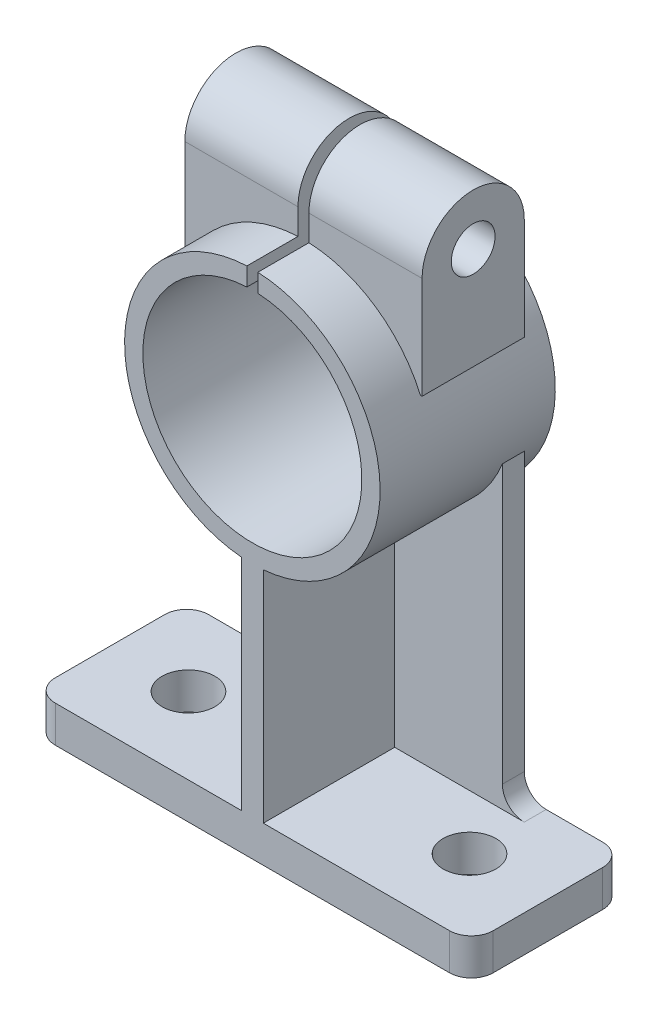
ISO-10303-21;
HEADER;
FILE_DESCRIPTION(('STEP AP214'),'2;1');
FILE_NAME('part.step','',(''),(''),'','','');
FILE_SCHEMA(('AUTOMOTIVE_DESIGN { 1 0 10303 214 1 1 1 1 }'));
ENDSEC;
DATA;
#1=APPLICATION_CONTEXT('core data for automotive mechanical design processes');
#2=APPLICATION_PROTOCOL_DEFINITION('international standard','automotive_design',2000,#1);
#3=PRODUCT_CONTEXT('',#1,'mechanical');
#4=PRODUCT('Part','Part','',(#3));
#5=PRODUCT_RELATED_PRODUCT_CATEGORY('part','',(#4));
#6=PRODUCT_DEFINITION_FORMATION('','',#4);
#7=PRODUCT_DEFINITION_CONTEXT('part definition',#1,'design');
#8=PRODUCT_DEFINITION('design','',#6,#7);
#9=PRODUCT_DEFINITION_SHAPE('','',#8);
#10=(LENGTH_UNIT() NAMED_UNIT(*) SI_UNIT(.MILLI.,.METRE.));
#11=(NAMED_UNIT(*) PLANE_ANGLE_UNIT() SI_UNIT($,.RADIAN.));
#12=(NAMED_UNIT(*) SI_UNIT($,.STERADIAN.) SOLID_ANGLE_UNIT());
#13=UNCERTAINTY_MEASURE_WITH_UNIT(LENGTH_MEASURE(1.E-05),#10,'distance_accuracy_value','');
#14=(GEOMETRIC_REPRESENTATION_CONTEXT(3) GLOBAL_UNCERTAINTY_ASSIGNED_CONTEXT((#13)) GLOBAL_UNIT_ASSIGNED_CONTEXT((#10,
#11,#12)) REPRESENTATION_CONTEXT('',''));
#15=CARTESIAN_POINT('',(0.,0.,0.));
#16=DIRECTION('',(0.,0.,1.));
#17=DIRECTION('',(1.,0.,0.));
#18=AXIS2_PLACEMENT_3D('',#15,#16,#17);
#19=CARTESIAN_POINT('',(0.,105.,42.));
#20=DIRECTION('',(0.,0.,-1.));
#21=DIRECTION('',(-1.,0.,0.));
#22=AXIS2_PLACEMENT_3D('',#19,#20,#21);
#23=CYLINDRICAL_SURFACE('',#22,35.);
#24=DIRECTION('',(0.,0.,-1.));
#25=VECTOR('',#24,1.);
#26=CARTESIAN_POINT('',(1.5,139.967842369812,42.));
#27=LINE('',#26,#25);
#28=CARTESIAN_POINT('',(1.5,139.967842369812,42.));
#29=VERTEX_POINT('',#28);
#30=CARTESIAN_POINT('',(1.5,139.967842369812,28.));
#31=VERTEX_POINT('',#30);
#32=EDGE_CURVE('E77',#29,#31,#27,.T.);
#33=ORIENTED_EDGE('',*,*,#32,.F.);
#34=CARTESIAN_POINT('',(0.,105.,42.));
#35=DIRECTION('',(0.,0.,1.));
#36=DIRECTION('',(1.,0.,0.));
#37=AXIS2_PLACEMENT_3D('',#34,#35,#36);
#38=CIRCLE('',#37,35.);
#39=CARTESIAN_POINT('',(3.0000000000002,70.1288084516746,42.));
#40=VERTEX_POINT('',#39);
#41=EDGE_CURVE('E294',#40,#29,#38,.T.);
#42=ORIENTED_EDGE('',*,*,#41,.F.);
#43=DIRECTION('',(0.,0.,-1.));
#44=VECTOR('',#43,1.);
#45=CARTESIAN_POINT('',(3.,70.1288084516746,42.));
#46=LINE('',#45,#44);
#47=CARTESIAN_POINT('',(3.,70.1288084516746,6.));
#48=VERTEX_POINT('',#47);
#49=EDGE_CURVE('E597',#40,#48,#46,.T.);
#50=ORIENTED_EDGE('',*,*,#49,.T.);
#51=CARTESIAN_POINT('',(0.,105.,6.));
#52=DIRECTION('',(0.,0.,1.));
#53=DIRECTION('',(1.,0.,0.));
#54=AXIS2_PLACEMENT_3D('',#51,#52,#53);
#55=CIRCLE('',#54,35.);
#56=CARTESIAN_POINT('',(32.5,92.0096189432335,6.));
#57=VERTEX_POINT('',#56);
#58=EDGE_CURVE('E12',#57,#48,#55,.F.);
#59=ORIENTED_EDGE('',*,*,#58,.F.);
#60=DIRECTION('',(0.,0.,-1.));
#61=VECTOR('',#60,1.);
#62=CARTESIAN_POINT('',(32.5,92.0096189432335,42.));
#63=LINE('',#62,#61);
#64=CARTESIAN_POINT('',(32.5,92.0096189432335,0.));
#65=VERTEX_POINT('',#64);
#66=EDGE_CURVE('E305',#57,#65,#63,.T.);
#67=ORIENTED_EDGE('',*,*,#66,.T.);
#68=CARTESIAN_POINT('',(0.,105.,0.));
#69=DIRECTION('',(0.,0.,1.));
#70=DIRECTION('',(1.,0.,0.));
#71=AXIS2_PLACEMENT_3D('',#68,#69,#70);
#72=CIRCLE('',#71,35.);
#73=CARTESIAN_POINT('',(-32.5,92.0096189432334,0.));
#74=VERTEX_POINT('',#73);
#75=EDGE_CURVE('E308',#65,#74,#72,.F.);
#76=ORIENTED_EDGE('',*,*,#75,.T.);
#77=DIRECTION('',(0.,0.,-1.));
#78=VECTOR('',#77,1.);
#79=CARTESIAN_POINT('',(-32.5,92.0096189432334,42.));
#80=LINE('',#79,#78);
#81=CARTESIAN_POINT('',(-32.5,92.0096189432334,6.));
#82=VERTEX_POINT('',#81);
#83=EDGE_CURVE('E301',#74,#82,#80,.F.);
#84=ORIENTED_EDGE('',*,*,#83,.T.);
#85=CARTESIAN_POINT('',(-3.,70.1288084516746,6.));
#86=VERTEX_POINT('',#85);
#87=EDGE_CURVE('E61',#86,#82,#55,.F.);
#88=ORIENTED_EDGE('',*,*,#87,.F.);
#89=DIRECTION('',(0.,0.,-1.));
#90=VECTOR('',#89,1.);
#91=CARTESIAN_POINT('',(-3.,70.1288084516746,42.));
#92=LINE('',#91,#90);
#93=CARTESIAN_POINT('',(-3.,70.1288084516746,42.));
#94=VERTEX_POINT('',#93);
#95=EDGE_CURVE('E594',#94,#86,#92,.T.);
#96=ORIENTED_EDGE('',*,*,#95,.F.);
#97=CARTESIAN_POINT('',(-1.5,139.967842369812,42.));
#98=VERTEX_POINT('',#97);
#99=EDGE_CURVE('E289',#98,#94,#38,.T.);
#100=ORIENTED_EDGE('',*,*,#99,.F.);
#101=DIRECTION('',(0.,0.,-1.));
#102=VECTOR('',#101,1.);
#103=CARTESIAN_POINT('',(-1.5,139.967842369812,42.));
#104=LINE('',#103,#102);
#105=CARTESIAN_POINT('',(-1.5,139.967842369812,28.));
#106=VERTEX_POINT('',#105);
#107=EDGE_CURVE('E284',#106,#98,#104,.F.);
#108=ORIENTED_EDGE('',*,*,#107,.F.);
#109=CARTESIAN_POINT('',(0.,105.,28.));
#110=DIRECTION('',(0.,0.,-1.));
#111=DIRECTION('',(-1.,0.,0.));
#112=AXIS2_PLACEMENT_3D('',#109,#110,#111);
#113=CIRCLE('',#112,35.);
#114=CARTESIAN_POINT('',(-32.0631442274312,119.034057939561,28.));
#115=VERTEX_POINT('',#114);
#116=EDGE_CURVE('E569',#115,#106,#113,.T.);
#117=ORIENTED_EDGE('',*,*,#116,.F.);
#118=DIRECTION('',(0.,0.,-1.));
#119=VECTOR('',#118,1.);
#120=CARTESIAN_POINT('',(-32.0631442274312,119.034057939561,42.));
#121=LINE('',#120,#119);
#122=CARTESIAN_POINT('',(-32.0631442274312,119.034057939561,0.));
#123=VERTEX_POINT('',#122);
#124=EDGE_CURVE('E560',#123,#115,#121,.F.);
#125=ORIENTED_EDGE('',*,*,#124,.F.);
#126=CARTESIAN_POINT('',(0.,105.,0.));
#127=DIRECTION('',(0.,0.,1.));
#128=DIRECTION('',(1.,0.,0.));
#129=AXIS2_PLACEMENT_3D('',#126,#127,#128);
#130=CIRCLE('',#129,35.);
#131=CARTESIAN_POINT('',(-1.5,139.967842369812,0.));
#132=VERTEX_POINT('',#131);
#133=EDGE_CURVE('E282',#132,#123,#130,.T.);
#134=ORIENTED_EDGE('',*,*,#133,.F.);
#135=CARTESIAN_POINT('',(-1.5,139.967842369812,-6.));
#136=VERTEX_POINT('',#135);
#137=EDGE_CURVE('E264',#136,#132,#104,.F.);
#138=ORIENTED_EDGE('',*,*,#137,.F.);
#139=CARTESIAN_POINT('',(0.,105.,-6.));
#140=DIRECTION('',(0.,0.,1.));
#141=DIRECTION('',(1.,0.,0.));
#142=AXIS2_PLACEMENT_3D('',#139,#140,#141);
#143=CIRCLE('',#142,35.);
#144=CARTESIAN_POINT('',(1.5,139.967842369812,-6.));
#145=VERTEX_POINT('',#144);
#146=EDGE_CURVE('E280',#136,#145,#143,.T.);
#147=ORIENTED_EDGE('',*,*,#146,.T.);
#148=CARTESIAN_POINT('',(1.5,139.967842369812,0.));
#149=VERTEX_POINT('',#148);
#150=EDGE_CURVE('E497',#149,#145,#27,.T.);
#151=ORIENTED_EDGE('',*,*,#150,.F.);
#152=CARTESIAN_POINT('',(32.0631442274312,119.034057939561,0.));
#153=VERTEX_POINT('',#152);
#154=EDGE_CURVE('E573',#153,#149,#130,.T.);
#155=ORIENTED_EDGE('',*,*,#154,.F.);
#156=DIRECTION('',(0.,0.,-1.));
#157=VECTOR('',#156,1.);
#158=CARTESIAN_POINT('',(32.0631442274312,119.034057939561,42.));
#159=LINE('',#158,#157);
#160=CARTESIAN_POINT('',(32.0631442274312,119.034057939561,28.));
#161=VERTEX_POINT('',#160);
#162=EDGE_CURVE('E564',#161,#153,#159,.T.);
#163=ORIENTED_EDGE('',*,*,#162,.F.);
#164=EDGE_CURVE('E568',#31,#161,#113,.T.);
#165=ORIENTED_EDGE('',*,*,#164,.F.);
#166=EDGE_LOOP('',(#33,#42,#50,#59,#67,#76,#84,#88,#96,#100,#108,#117,#125,#134,#138,#147,#151,
#155,#163,#165));
#167=FACE_BOUND('',#166,.T.);
#168=ADVANCED_FACE('F51',(#167),#23,.T.);
#169=CARTESIAN_POINT('',(0.,105.,42.));
#170=DIRECTION('',(0.,0.,-1.));
#171=DIRECTION('',(-1.,0.,0.));
#172=AXIS2_PLACEMENT_3D('',#169,#170,#171);
#173=CYLINDRICAL_SURFACE('',#172,30.);
#174=CARTESIAN_POINT('',(0.,105.,42.));
#175=DIRECTION('',(0.,0.,1.));
#176=DIRECTION('',(1.,0.,0.));
#177=AXIS2_PLACEMENT_3D('',#174,#175,#176);
#178=CIRCLE('',#177,30.);
#179=CARTESIAN_POINT('',(-1.5,134.962476533157,42.));
#180=VERTEX_POINT('',#179);
#181=CARTESIAN_POINT('',(1.5,134.962476533157,42.));
#182=VERTEX_POINT('',#181);
#183=EDGE_CURVE('E290',#180,#182,#178,.T.);
#184=ORIENTED_EDGE('',*,*,#183,.T.);
#185=DIRECTION('',(0.,0.,-1.));
#186=VECTOR('',#185,1.);
#187=CARTESIAN_POINT('',(1.5,134.962476533157,42.));
#188=LINE('',#187,#186);
#189=CARTESIAN_POINT('',(1.5,134.962476533157,-6.));
#190=VERTEX_POINT('',#189);
#191=EDGE_CURVE('E500',#182,#190,#188,.T.);
#192=ORIENTED_EDGE('',*,*,#191,.T.);
#193=CARTESIAN_POINT('',(0.,105.,-6.));
#194=DIRECTION('',(0.,0.,1.));
#195=DIRECTION('',(1.,0.,0.));
#196=AXIS2_PLACEMENT_3D('',#193,#194,#195);
#197=CIRCLE('',#196,30.);
#198=CARTESIAN_POINT('',(-1.5,134.962476533157,-6.));
#199=VERTEX_POINT('',#198);
#200=EDGE_CURVE('E297',#199,#190,#197,.T.);
#201=ORIENTED_EDGE('',*,*,#200,.F.);
#202=DIRECTION('',(0.,0.,-1.));
#203=VECTOR('',#202,1.);
#204=CARTESIAN_POINT('',(-1.5,134.962476533157,42.));
#205=LINE('',#204,#203);
#206=EDGE_CURVE('E267',#199,#180,#205,.F.);
#207=ORIENTED_EDGE('',*,*,#206,.T.);
#208=EDGE_LOOP('',(#184,#192,#201,#207));
#209=FACE_BOUND('',#208,.T.);
#210=ADVANCED_FACE('F605',(#209),#173,.F.);
#211=CARTESIAN_POINT('',(-60.,10.,42.));
#212=DIRECTION('',(0.,0.,-1.));
#213=DIRECTION('',(-1.,0.,0.));
#214=AXIS2_PLACEMENT_3D('',#211,#212,#213);
#215=PLANE('',#214);
#216=DIRECTION('',(0.,1.,0.));
#217=VECTOR('',#216,1.);
#218=CARTESIAN_POINT('',(1.5,105.,42.));
#219=LINE('',#218,#217);
#220=EDGE_CURVE('E273',#182,#29,#219,.T.);
#221=ORIENTED_EDGE('',*,*,#220,.F.);
#222=ORIENTED_EDGE('',*,*,#183,.F.);
#223=DIRECTION('',(0.,-1.,0.));
#224=VECTOR('',#223,1.);
#225=CARTESIAN_POINT('',(-1.5,105.,42.));
#226=LINE('',#225,#224);
#227=EDGE_CURVE('E467',#98,#180,#226,.T.);
#228=ORIENTED_EDGE('',*,*,#227,.F.);
#229=ORIENTED_EDGE('',*,*,#99,.T.);
#230=DIRECTION('',(0.,-1.,0.));
#231=VECTOR('',#230,1.);
#232=CARTESIAN_POINT('',(-3.,10.,42.));
#233=LINE('',#232,#231);
#234=CARTESIAN_POINT('',(-3.,10.,42.));
#235=VERTEX_POINT('',#234);
#236=EDGE_CURVE('E582',#94,#235,#233,.T.);
#237=ORIENTED_EDGE('',*,*,#236,.T.);
#238=DIRECTION('',(1.,0.,0.));
#239=VECTOR('',#238,1.);
#240=CARTESIAN_POINT('',(-60.,10.,42.));
#241=LINE('',#240,#239);
#242=CARTESIAN_POINT('',(-54.,10.,42.));
#243=VERTEX_POINT('',#242);
#244=EDGE_CURVE('E362',#243,#235,#241,.T.);
#245=ORIENTED_EDGE('',*,*,#244,.F.);
#246=DIRECTION('',(0.,-1.,0.));
#247=VECTOR('',#246,1.);
#248=CARTESIAN_POINT('',(-54.,10.,42.));
#249=LINE('',#248,#247);
#250=CARTESIAN_POINT('',(-54.,0.,42.));
#251=VERTEX_POINT('',#250);
#252=EDGE_CURVE('E399',#243,#251,#249,.T.);
#253=ORIENTED_EDGE('',*,*,#252,.T.);
#254=DIRECTION('',(1.,0.,0.));
#255=VECTOR('',#254,1.);
#256=CARTESIAN_POINT('',(-60.,0.,42.));
#257=LINE('',#256,#255);
#258=CARTESIAN_POINT('',(54.,0.,42.));
#259=VERTEX_POINT('',#258);
#260=EDGE_CURVE('E352',#251,#259,#257,.T.);
#261=ORIENTED_EDGE('',*,*,#260,.T.);
#262=DIRECTION('',(0.,-1.,0.));
#263=VECTOR('',#262,1.);
#264=CARTESIAN_POINT('',(54.,10.,42.));
#265=LINE('',#264,#263);
#266=CARTESIAN_POINT('',(54.,10.,42.));
#267=VERTEX_POINT('',#266);
#268=EDGE_CURVE('E403',#259,#267,#265,.F.);
#269=ORIENTED_EDGE('',*,*,#268,.T.);
#270=CARTESIAN_POINT('',(3.,10.,42.));
#271=VERTEX_POINT('',#270);
#272=EDGE_CURVE('E361',#271,#267,#241,.T.);
#273=ORIENTED_EDGE('',*,*,#272,.F.);
#274=DIRECTION('',(0.,1.,0.));
#275=VECTOR('',#274,1.);
#276=CARTESIAN_POINT('',(3.,10.,42.));
#277=LINE('',#276,#275);
#278=EDGE_CURVE('E578',#271,#40,#277,.T.);
#279=ORIENTED_EDGE('',*,*,#278,.T.);
#280=ORIENTED_EDGE('',*,*,#41,.T.);
#281=EDGE_LOOP('',(#221,#222,#228,#229,#237,#245,#253,#261,#269,#273,#279,#280));
#282=FACE_BOUND('',#281,.T.);
#283=ADVANCED_FACE('F611',(#282),#215,.F.);
#284=CARTESIAN_POINT('',(0.,105.,-6.));
#285=DIRECTION('',(0.,0.,1.));
#286=DIRECTION('',(1.,0.,0.));
#287=AXIS2_PLACEMENT_3D('',#284,#285,#286);
#288=PLANE('',#287);
#289=DIRECTION('',(0.,1.,0.));
#290=VECTOR('',#289,1.);
#291=CARTESIAN_POINT('',(1.5,105.,-6.));
#292=LINE('',#291,#290);
#293=EDGE_CURVE('E274',#190,#145,#292,.T.);
#294=ORIENTED_EDGE('',*,*,#293,.T.);
#295=ORIENTED_EDGE('',*,*,#146,.F.);
#296=DIRECTION('',(0.,-1.,0.));
#297=VECTOR('',#296,1.);
#298=CARTESIAN_POINT('',(-1.5,105.,-6.));
#299=LINE('',#298,#297);
#300=EDGE_CURVE('E261',#136,#199,#299,.T.);
#301=ORIENTED_EDGE('',*,*,#300,.T.);
#302=ORIENTED_EDGE('',*,*,#200,.T.);
#303=EDGE_LOOP('',(#294,#295,#301,#302));
#304=FACE_BOUND('',#303,.T.);
#305=ADVANCED_FACE('F287',(#304),#288,.F.);
#306=CARTESIAN_POINT('',(32.5,126.068220276628,0.));
#307=DIRECTION('',(0.,0.,1.));
#308=DIRECTION('',(1.,0.,0.));
#309=AXIS2_PLACEMENT_3D('',#306,#307,#308);
#310=PLANE('',#309);
#311=DIRECTION('',(0.,-1.,0.));
#312=VECTOR('',#311,1.);
#313=CARTESIAN_POINT('',(1.5,126.068220276628,0.));
#314=LINE('',#313,#312);
#315=CARTESIAN_POINT('',(1.5,147.,0.));
#316=VERTEX_POINT('',#315);
#317=EDGE_CURVE('E494',#316,#149,#314,.T.);
#318=ORIENTED_EDGE('',*,*,#317,.F.);
#319=DIRECTION('',(-1.,0.,0.));
#320=VECTOR('',#319,1.);
#321=CARTESIAN_POINT('',(32.5,147.,0.));
#322=LINE('',#321,#320);
#323=CARTESIAN_POINT('',(32.5,147.,0.));
#324=VERTEX_POINT('',#323);
#325=EDGE_CURVE('E556',#324,#316,#322,.T.);
#326=ORIENTED_EDGE('',*,*,#325,.F.);
#327=DIRECTION('',(0.,1.,0.));
#328=VECTOR('',#327,1.);
#329=CARTESIAN_POINT('',(32.5,119.034057939561,0.));
#330=LINE('',#329,#328);
#331=CARTESIAN_POINT('',(32.5,119.034057939561,0.));
#332=VERTEX_POINT('',#331);
#333=EDGE_CURVE('E513',#332,#324,#330,.T.);
#334=ORIENTED_EDGE('',*,*,#333,.F.);
#335=DIRECTION('',(-1.,0.,0.));
#336=VECTOR('',#335,1.);
#337=CARTESIAN_POINT('',(32.5,119.034057939561,0.));
#338=LINE('',#337,#336);
#339=EDGE_CURVE('E541',#332,#153,#338,.T.);
#340=ORIENTED_EDGE('',*,*,#339,.T.);
#341=ORIENTED_EDGE('',*,*,#154,.T.);
#342=EDGE_LOOP('',(#318,#326,#334,#340,#341));
#343=FACE_BOUND('',#342,.T.);
#344=ADVANCED_FACE('F926',(#343),#310,.F.);
#345=DIRECTION('',(0.,1.,0.));
#346=VECTOR('',#345,1.);
#347=CARTESIAN_POINT('',(-1.5,126.068220276628,0.));
#348=LINE('',#347,#346);
#349=CARTESIAN_POINT('',(-1.5,147.,0.));
#350=VERTEX_POINT('',#349);
#351=EDGE_CURVE('E482',#132,#350,#348,.T.);
#352=ORIENTED_EDGE('',*,*,#351,.F.);
#353=ORIENTED_EDGE('',*,*,#133,.T.);
#354=CARTESIAN_POINT('',(-32.5,119.034057939561,0.));
#355=VERTEX_POINT('',#354);
#356=EDGE_CURVE('E526',#123,#355,#338,.T.);
#357=ORIENTED_EDGE('',*,*,#356,.T.);
#358=DIRECTION('',(0.,1.,0.));
#359=VECTOR('',#358,1.);
#360=CARTESIAN_POINT('',(-32.5,126.068220276628,0.));
#361=LINE('',#360,#359);
#362=CARTESIAN_POINT('',(-32.5,147.,0.));
#363=VERTEX_POINT('',#362);
#364=EDGE_CURVE('E509',#355,#363,#361,.T.);
#365=ORIENTED_EDGE('',*,*,#364,.T.);
#366=EDGE_CURVE('E555',#350,#363,#322,.T.);
#367=ORIENTED_EDGE('',*,*,#366,.F.);
#368=EDGE_LOOP('',(#352,#353,#357,#365,#367));
#369=FACE_BOUND('',#368,.T.);
#370=ADVANCED_FACE('F918',(#369),#310,.F.);
#371=CARTESIAN_POINT('',(32.5,147.,14.));
#372=DIRECTION('',(-1.,0.,0.));
#373=DIRECTION('',(0.,0.,1.));
#374=AXIS2_PLACEMENT_3D('',#371,#372,#373);
#375=CYLINDRICAL_SURFACE('',#374,14.);
#376=CARTESIAN_POINT('',(1.5,147.,14.));
#377=DIRECTION('',(-1.,0.,0.));
#378=DIRECTION('',(0.,0.,1.));
#379=AXIS2_PLACEMENT_3D('',#376,#377,#378);
#380=CIRCLE('',#379,14.);
#381=CARTESIAN_POINT('',(1.5,147.,28.));
#382=VERTEX_POINT('',#381);
#383=EDGE_CURVE('E491',#382,#316,#380,.T.);
#384=ORIENTED_EDGE('',*,*,#383,.F.);
#385=DIRECTION('',(-1.,0.,0.));
#386=VECTOR('',#385,1.);
#387=CARTESIAN_POINT('',(32.5,147.,28.));
#388=LINE('',#387,#386);
#389=CARTESIAN_POINT('',(32.5,147.,28.));
#390=VERTEX_POINT('',#389);
#391=EDGE_CURVE('E551',#390,#382,#388,.T.);
#392=ORIENTED_EDGE('',*,*,#391,.F.);
#393=CARTESIAN_POINT('',(32.5,147.,14.));
#394=DIRECTION('',(1.,0.,0.));
#395=DIRECTION('',(0.,0.,-1.));
#396=AXIS2_PLACEMENT_3D('',#393,#394,#395);
#397=CIRCLE('',#396,14.);
#398=EDGE_CURVE('E516',#324,#390,#397,.T.);
#399=ORIENTED_EDGE('',*,*,#398,.F.);
#400=ORIENTED_EDGE('',*,*,#325,.T.);
#401=EDGE_LOOP('',(#384,#392,#399,#400));
#402=FACE_BOUND('',#401,.T.);
#403=ADVANCED_FACE('F909',(#402),#375,.T.);
#404=CARTESIAN_POINT('',(-1.5,147.,14.));
#405=DIRECTION('',(1.,0.,0.));
#406=DIRECTION('',(0.,0.,-1.));
#407=AXIS2_PLACEMENT_3D('',#404,#405,#406);
#408=CIRCLE('',#407,14.);
#409=CARTESIAN_POINT('',(-1.5,147.,28.));
#410=VERTEX_POINT('',#409);
#411=EDGE_CURVE('E69',#350,#410,#408,.T.);
#412=ORIENTED_EDGE('',*,*,#411,.F.);
#413=ORIENTED_EDGE('',*,*,#366,.T.);
#414=CARTESIAN_POINT('',(-32.5,147.,14.));
#415=DIRECTION('',(1.,0.,0.));
#416=DIRECTION('',(0.,0.,-1.));
#417=AXIS2_PLACEMENT_3D('',#414,#415,#416);
#418=CIRCLE('',#417,14.);
#419=CARTESIAN_POINT('',(-32.5,147.,28.));
#420=VERTEX_POINT('',#419);
#421=EDGE_CURVE('E530',#363,#420,#418,.T.);
#422=ORIENTED_EDGE('',*,*,#421,.T.);
#423=EDGE_CURVE('E550',#410,#420,#388,.T.);
#424=ORIENTED_EDGE('',*,*,#423,.F.);
#425=EDGE_LOOP('',(#412,#413,#422,#424));
#426=FACE_BOUND('',#425,.T.);
#427=ADVANCED_FACE('F901',(#426),#375,.T.);
#428=CARTESIAN_POINT('',(32.5,119.034057939561,28.));
#429=DIRECTION('',(0.,0.,-1.));
#430=DIRECTION('',(-1.,0.,0.));
#431=AXIS2_PLACEMENT_3D('',#428,#429,#430);
#432=PLANE('',#431);
#433=DIRECTION('',(0.,1.,0.));
#434=VECTOR('',#433,1.);
#435=CARTESIAN_POINT('',(1.5,119.034057939561,28.));
#436=LINE('',#435,#434);
#437=EDGE_CURVE('E488',#31,#382,#436,.T.);
#438=ORIENTED_EDGE('',*,*,#437,.F.);
#439=ORIENTED_EDGE('',*,*,#164,.T.);
#440=DIRECTION('',(-1.,0.,0.));
#441=VECTOR('',#440,1.);
#442=CARTESIAN_POINT('',(32.5,119.034057939561,28.));
#443=LINE('',#442,#441);
#444=CARTESIAN_POINT('',(32.5,119.034057939561,28.));
#445=VERTEX_POINT('',#444);
#446=EDGE_CURVE('E546',#445,#161,#443,.T.);
#447=ORIENTED_EDGE('',*,*,#446,.F.);
#448=DIRECTION('',(0.,-1.,0.));
#449=VECTOR('',#448,1.);
#450=CARTESIAN_POINT('',(32.5,119.034057939561,28.));
#451=LINE('',#450,#449);
#452=EDGE_CURVE('E520',#390,#445,#451,.T.);
#453=ORIENTED_EDGE('',*,*,#452,.F.);
#454=ORIENTED_EDGE('',*,*,#391,.T.);
#455=EDGE_LOOP('',(#438,#439,#447,#453,#454));
#456=FACE_BOUND('',#455,.T.);
#457=ADVANCED_FACE('F892',(#456),#432,.F.);
#458=DIRECTION('',(0.,-1.,0.));
#459=VECTOR('',#458,1.);
#460=CARTESIAN_POINT('',(-1.5,119.034057939561,28.));
#461=LINE('',#460,#459);
#462=EDGE_CURVE('E466',#410,#106,#461,.T.);
#463=ORIENTED_EDGE('',*,*,#462,.F.);
#464=ORIENTED_EDGE('',*,*,#423,.T.);
#465=DIRECTION('',(0.,-1.,0.));
#466=VECTOR('',#465,1.);
#467=CARTESIAN_POINT('',(-32.5,119.034057939561,28.));
#468=LINE('',#467,#466);
#469=CARTESIAN_POINT('',(-32.5,119.034057939561,28.));
#470=VERTEX_POINT('',#469);
#471=EDGE_CURVE('E534',#420,#470,#468,.T.);
#472=ORIENTED_EDGE('',*,*,#471,.T.);
#473=EDGE_CURVE('E545',#115,#470,#443,.T.);
#474=ORIENTED_EDGE('',*,*,#473,.F.);
#475=ORIENTED_EDGE('',*,*,#116,.T.);
#476=EDGE_LOOP('',(#463,#464,#472,#474,#475));
#477=FACE_BOUND('',#476,.T.);
#478=ADVANCED_FACE('F884',(#477),#432,.F.);
#479=CARTESIAN_POINT('',(32.5,147.,14.));
#480=DIRECTION('',(-1.,0.,0.));
#481=DIRECTION('',(0.,0.,1.));
#482=AXIS2_PLACEMENT_3D('',#479,#480,#481);
#483=CYLINDRICAL_SURFACE('',#482,6.00000000000001);
#484=CARTESIAN_POINT('',(32.5,147.,14.));
#485=DIRECTION('',(1.,0.,0.));
#486=DIRECTION('',(0.,0.,-1.));
#487=AXIS2_PLACEMENT_3D('',#484,#485,#486);
#488=CIRCLE('',#487,6.00000000000001);
#489=CARTESIAN_POINT('',(32.5,147.,7.99999999999999));
#490=VERTEX_POINT('',#489);
#491=EDGE_CURVE('E505',#490,#490,#488,.T.);
#492=ORIENTED_EDGE('',*,*,#491,.T.);
#493=EDGE_LOOP('',(#492));
#494=FACE_BOUND('',#493,.T.);
#495=CARTESIAN_POINT('',(1.5,147.,14.));
#496=DIRECTION('',(-1.,0.,0.));
#497=DIRECTION('',(0.,0.,1.));
#498=AXIS2_PLACEMENT_3D('',#495,#496,#497);
#499=CIRCLE('',#498,6.00000000000001);
#500=CARTESIAN_POINT('',(1.5,147.,20.));
#501=VERTEX_POINT('',#500);
#502=EDGE_CURVE('E55',#501,#501,#499,.T.);
#503=ORIENTED_EDGE('',*,*,#502,.T.);
#504=EDGE_LOOP('',(#503));
#505=FACE_BOUND('',#504,.T.);
#506=ADVANCED_FACE('F875',(#494,#505),#483,.F.);
#507=CARTESIAN_POINT('',(-32.5,147.,14.));
#508=DIRECTION('',(1.,0.,0.));
#509=DIRECTION('',(0.,0.,-1.));
#510=AXIS2_PLACEMENT_3D('',#507,#508,#509);
#511=CIRCLE('',#510,6.00000000000001);
#512=CARTESIAN_POINT('',(-32.5,147.,7.99999999999999));
#513=VERTEX_POINT('',#512);
#514=EDGE_CURVE('E504',#513,#513,#511,.T.);
#515=ORIENTED_EDGE('',*,*,#514,.F.);
#516=EDGE_LOOP('',(#515));
#517=FACE_BOUND('',#516,.T.);
#518=CARTESIAN_POINT('',(-1.5,147.,14.));
#519=DIRECTION('',(1.,0.,0.));
#520=DIRECTION('',(0.,0.,-1.));
#521=AXIS2_PLACEMENT_3D('',#518,#519,#520);
#522=CIRCLE('',#521,6.00000000000001);
#523=CARTESIAN_POINT('',(-1.5,147.,7.99999999999999));
#524=VERTEX_POINT('',#523);
#525=EDGE_CURVE('E463',#524,#524,#522,.T.);
#526=ORIENTED_EDGE('',*,*,#525,.T.);
#527=EDGE_LOOP('',(#526));
#528=FACE_BOUND('',#527,.T.);
#529=ADVANCED_FACE('F727',(#517,#528),#483,.F.);
#530=CARTESIAN_POINT('',(0.,10.,0.));
#531=DIRECTION('',(0.,-1.,0.));
#532=DIRECTION('',(0.,0.,-1.));
#533=AXIS2_PLACEMENT_3D('',#530,#531,#532);
#534=PLANE('',#533);
#535=CARTESIAN_POINT('',(38.5,10.,21.));
#536=DIRECTION('',(0.,-1.,0.));
#537=DIRECTION('',(0.,0.,1.));
#538=AXIS2_PLACEMENT_3D('',#535,#536,#537);
#539=CIRCLE('',#538,7.24056590918217);
#540=CARTESIAN_POINT('',(38.5,10.,28.2405659091822));
#541=VERTEX_POINT('',#540);
#542=EDGE_CURVE('E311',#541,#541,#539,.T.);
#543=ORIENTED_EDGE('',*,*,#542,.T.);
#544=EDGE_LOOP('',(#543));
#545=FACE_BOUND('',#544,.T.);
#546=DIRECTION('',(0.,0.,-1.));
#547=VECTOR('',#546,1.);
#548=CARTESIAN_POINT('',(3.,10.,42.));
#549=LINE('',#548,#547);
#550=CARTESIAN_POINT('',(3.,10.,6.));
#551=VERTEX_POINT('',#550);
#552=EDGE_CURVE('E601',#271,#551,#549,.T.);
#553=ORIENTED_EDGE('',*,*,#552,.F.);
#554=ORIENTED_EDGE('',*,*,#272,.T.);
#555=CARTESIAN_POINT('',(54.,10.,36.));
#556=DIRECTION('',(0.,-1.,0.));
#557=DIRECTION('',(0.,0.,-1.));
#558=AXIS2_PLACEMENT_3D('',#555,#556,#557);
#559=CIRCLE('',#558,6.);
#560=CARTESIAN_POINT('',(60.,10.,36.));
#561=VERTEX_POINT('',#560);
#562=EDGE_CURVE('E416',#267,#561,#559,.F.);
#563=ORIENTED_EDGE('',*,*,#562,.T.);
#564=DIRECTION('',(0.,0.,-1.));
#565=VECTOR('',#564,1.);
#566=CARTESIAN_POINT('',(60.,10.,42.));
#567=LINE('',#566,#565);
#568=CARTESIAN_POINT('',(60.,10.,6.00000000000001));
#569=VERTEX_POINT('',#568);
#570=EDGE_CURVE('E347',#561,#569,#567,.T.);
#571=ORIENTED_EDGE('',*,*,#570,.T.);
#572=CARTESIAN_POINT('',(54.,10.,6.));
#573=DIRECTION('',(0.,-1.,0.));
#574=DIRECTION('',(0.,0.,-1.));
#575=AXIS2_PLACEMENT_3D('',#572,#573,#574);
#576=CIRCLE('',#575,6.);
#577=CARTESIAN_POINT('',(54.,10.,0.));
#578=VERTEX_POINT('',#577);
#579=EDGE_CURVE('E413',#569,#578,#576,.F.);
#580=ORIENTED_EDGE('',*,*,#579,.T.);
#581=DIRECTION('',(-1.,0.,0.));
#582=VECTOR('',#581,1.);
#583=CARTESIAN_POINT('',(-60.,10.,0.));
#584=LINE('',#583,#582);
#585=CARTESIAN_POINT('',(38.5,10.,0.));
#586=VERTEX_POINT('',#585);
#587=EDGE_CURVE('E353',#578,#586,#584,.T.);
#588=ORIENTED_EDGE('',*,*,#587,.T.);
#589=DIRECTION('',(0.,0.,-1.));
#590=VECTOR('',#589,1.);
#591=CARTESIAN_POINT('',(38.5,10.,6.));
#592=LINE('',#591,#590);
#593=CARTESIAN_POINT('',(38.5,10.,6.));
#594=VERTEX_POINT('',#593);
#595=EDGE_CURVE('E434',#586,#594,#592,.F.);
#596=ORIENTED_EDGE('',*,*,#595,.T.);
#597=DIRECTION('',(1.,0.,0.));
#598=VECTOR('',#597,1.);
#599=CARTESIAN_POINT('',(-32.5,10.,6.));
#600=LINE('',#599,#598);
#601=EDGE_CURVE('E336',#551,#594,#600,.T.);
#602=ORIENTED_EDGE('',*,*,#601,.F.);
#603=EDGE_LOOP('',(#553,#554,#563,#571,#580,#588,#596,#602));
#604=FACE_BOUND('',#603,.T.);
#605=ADVANCED_FACE('F682',(#545,#604),#534,.F.);
#606=CARTESIAN_POINT('',(-38.5,10.,21.));
#607=DIRECTION('',(0.,1.,0.));
#608=DIRECTION('',(0.,0.,1.));
#609=AXIS2_PLACEMENT_3D('',#606,#607,#608);
#610=CIRCLE('',#609,7.24056590918217);
#611=CARTESIAN_POINT('',(-38.5,10.,28.2405659091822));
#612=VERTEX_POINT('',#611);
#613=EDGE_CURVE('E316',#612,#612,#610,.T.);
#614=ORIENTED_EDGE('',*,*,#613,.F.);
#615=EDGE_LOOP('',(#614));
#616=FACE_BOUND('',#615,.T.);
#617=DIRECTION('',(0.,0.,-1.));
#618=VECTOR('',#617,1.);
#619=CARTESIAN_POINT('',(-3.,10.,42.));
#620=LINE('',#619,#618);
#621=CARTESIAN_POINT('',(-3.,10.,6.));
#622=VERTEX_POINT('',#621);
#623=EDGE_CURVE('E586',#235,#622,#620,.T.);
#624=ORIENTED_EDGE('',*,*,#623,.T.);
#625=CARTESIAN_POINT('',(-38.5,10.,6.));
#626=VERTEX_POINT('',#625);
#627=EDGE_CURVE('E337',#626,#622,#600,.T.);
#628=ORIENTED_EDGE('',*,*,#627,.F.);
#629=DIRECTION('',(0.,0.,-1.));
#630=VECTOR('',#629,1.);
#631=CARTESIAN_POINT('',(-38.5,10.,0.));
#632=LINE('',#631,#630);
#633=CARTESIAN_POINT('',(-38.5,10.,0.));
#634=VERTEX_POINT('',#633);
#635=EDGE_CURVE('E438',#626,#634,#632,.T.);
#636=ORIENTED_EDGE('',*,*,#635,.T.);
#637=CARTESIAN_POINT('',(-54.,10.,0.));
#638=VERTEX_POINT('',#637);
#639=EDGE_CURVE('E351',#634,#638,#584,.T.);
#640=ORIENTED_EDGE('',*,*,#639,.T.);
#641=CARTESIAN_POINT('',(-54.,10.,6.));
#642=DIRECTION('',(0.,-1.,0.));
#643=DIRECTION('',(0.,0.,-1.));
#644=AXIS2_PLACEMENT_3D('',#641,#642,#643);
#645=CIRCLE('',#644,6.);
#646=CARTESIAN_POINT('',(-60.,10.,6.00000000000001));
#647=VERTEX_POINT('',#646);
#648=EDGE_CURVE('E410',#638,#647,#645,.F.);
#649=ORIENTED_EDGE('',*,*,#648,.T.);
#650=DIRECTION('',(0.,0.,1.));
#651=VECTOR('',#650,1.);
#652=CARTESIAN_POINT('',(-60.,10.,42.));
#653=LINE('',#652,#651);
#654=CARTESIAN_POINT('',(-60.,10.,36.));
#655=VERTEX_POINT('',#654);
#656=EDGE_CURVE('E357',#647,#655,#653,.T.);
#657=ORIENTED_EDGE('',*,*,#656,.T.);
#658=CARTESIAN_POINT('',(-54.,10.,36.));
#659=DIRECTION('',(0.,-1.,0.));
#660=DIRECTION('',(0.,0.,-1.));
#661=AXIS2_PLACEMENT_3D('',#658,#659,#660);
#662=CIRCLE('',#661,6.);
#663=EDGE_CURVE('E407',#655,#243,#662,.F.);
#664=ORIENTED_EDGE('',*,*,#663,.T.);
#665=ORIENTED_EDGE('',*,*,#244,.T.);
#666=EDGE_LOOP('',(#624,#628,#636,#640,#649,#657,#664,#665));
#667=FACE_BOUND('',#666,.T.);
#668=ADVANCED_FACE('F636',(#616,#667),#534,.F.);
#669=CARTESIAN_POINT('',(0.,0.,6.));
#670=DIRECTION('',(0.,0.,1.));
#671=DIRECTION('',(1.,0.,0.));
#672=AXIS2_PLACEMENT_3D('',#669,#670,#671);
#673=PLANE('',#672);
#674=ORIENTED_EDGE('',*,*,#58,.T.);
#675=DIRECTION('',(0.,1.,0.));
#676=VECTOR('',#675,1.);
#677=CARTESIAN_POINT('',(3.,10.,6.));
#678=LINE('',#677,#676);
#679=EDGE_CURVE('E577',#551,#48,#678,.T.);
#680=ORIENTED_EDGE('',*,*,#679,.F.);
#681=ORIENTED_EDGE('',*,*,#601,.T.);
#682=CARTESIAN_POINT('',(38.5,16.,6.));
#683=DIRECTION('',(0.,0.,1.));
#684=DIRECTION('',(1.,0.,0.));
#685=AXIS2_PLACEMENT_3D('',#682,#683,#684);
#686=CIRCLE('',#685,6.);
#687=CARTESIAN_POINT('',(32.5,16.,6.));
#688=VERTEX_POINT('',#687);
#689=EDGE_CURVE('E461',#594,#688,#686,.F.);
#690=ORIENTED_EDGE('',*,*,#689,.T.);
#691=DIRECTION('',(0.,1.,0.));
#692=VECTOR('',#691,1.);
#693=CARTESIAN_POINT('',(32.5,105.,6.));
#694=LINE('',#693,#692);
#695=EDGE_CURVE('E328',#688,#57,#694,.T.);
#696=ORIENTED_EDGE('',*,*,#695,.T.);
#697=EDGE_LOOP('',(#674,#680,#681,#690,#696));
#698=FACE_BOUND('',#697,.T.);
#699=ADVANCED_FACE('F688',(#698),#673,.T.);
#700=ORIENTED_EDGE('',*,*,#627,.T.);
#701=DIRECTION('',(0.,-1.,0.));
#702=VECTOR('',#701,1.);
#703=CARTESIAN_POINT('',(-3.,10.,6.));
#704=LINE('',#703,#702);
#705=EDGE_CURVE('E583',#86,#622,#704,.T.);
#706=ORIENTED_EDGE('',*,*,#705,.F.);
#707=ORIENTED_EDGE('',*,*,#87,.T.);
#708=DIRECTION('',(0.,-1.,0.));
#709=VECTOR('',#708,1.);
#710=CARTESIAN_POINT('',(-32.5,105.,6.));
#711=LINE('',#710,#709);
#712=CARTESIAN_POINT('',(-32.5,16.,6.));
#713=VERTEX_POINT('',#712);
#714=EDGE_CURVE('E332',#82,#713,#711,.T.);
#715=ORIENTED_EDGE('',*,*,#714,.T.);
#716=CARTESIAN_POINT('',(-38.5,16.,6.));
#717=DIRECTION('',(0.,0.,1.));
#718=DIRECTION('',(1.,0.,0.));
#719=AXIS2_PLACEMENT_3D('',#716,#717,#718);
#720=CIRCLE('',#719,6.);
#721=EDGE_CURVE('E454',#713,#626,#720,.F.);
#722=ORIENTED_EDGE('',*,*,#721,.T.);
#723=EDGE_LOOP('',(#700,#706,#707,#715,#722));
#724=FACE_BOUND('',#723,.T.);
#725=ADVANCED_FACE('F622',(#724),#673,.T.);
#726=CARTESIAN_POINT('',(32.5,105.,6.));
#727=DIRECTION('',(-1.,0.,0.));
#728=DIRECTION('',(0.,-1.,0.));
#729=AXIS2_PLACEMENT_3D('',#726,#727,#728);
#730=PLANE('',#729);
#731=ORIENTED_EDGE('',*,*,#66,.F.);
#732=ORIENTED_EDGE('',*,*,#695,.F.);
#733=DIRECTION('',(0.,0.,-1.));
#734=VECTOR('',#733,1.);
#735=CARTESIAN_POINT('',(32.5,16.,0.));
#736=LINE('',#735,#734);
#737=CARTESIAN_POINT('',(32.5,16.,0.));
#738=VERTEX_POINT('',#737);
#739=EDGE_CURVE('E446',#688,#738,#736,.T.);
#740=ORIENTED_EDGE('',*,*,#739,.T.);
#741=DIRECTION('',(0.,1.,0.));
#742=VECTOR('',#741,1.);
#743=CARTESIAN_POINT('',(32.5,105.,0.));
#744=LINE('',#743,#742);
#745=EDGE_CURVE('E324',#738,#65,#744,.T.);
#746=ORIENTED_EDGE('',*,*,#745,.T.);
#747=EDGE_LOOP('',(#731,#732,#740,#746));
#748=FACE_BOUND('',#747,.T.);
#749=ADVANCED_FACE('F692',(#748),#730,.F.);
#750=CARTESIAN_POINT('',(-32.5,105.,6.));
#751=DIRECTION('',(1.,0.,0.));
#752=DIRECTION('',(0.,1.,0.));
#753=AXIS2_PLACEMENT_3D('',#750,#751,#752);
#754=PLANE('',#753);
#755=ORIENTED_EDGE('',*,*,#83,.F.);
#756=DIRECTION('',(0.,-1.,0.));
#757=VECTOR('',#756,1.);
#758=CARTESIAN_POINT('',(-32.5,105.,0.));
#759=LINE('',#758,#757);
#760=CARTESIAN_POINT('',(-32.5,16.,0.));
#761=VERTEX_POINT('',#760);
#762=EDGE_CURVE('E333',#74,#761,#759,.T.);
#763=ORIENTED_EDGE('',*,*,#762,.T.);
#764=DIRECTION('',(0.,0.,-1.));
#765=VECTOR('',#764,1.);
#766=CARTESIAN_POINT('',(-32.5,16.,6.));
#767=LINE('',#766,#765);
#768=EDGE_CURVE('E442',#761,#713,#767,.F.);
#769=ORIENTED_EDGE('',*,*,#768,.T.);
#770=ORIENTED_EDGE('',*,*,#714,.F.);
#771=EDGE_LOOP('',(#755,#763,#769,#770));
#772=FACE_BOUND('',#771,.T.);
#773=ADVANCED_FACE('F629',(#772),#754,.F.);
#774=CARTESIAN_POINT('',(60.,10.,42.));
#775=DIRECTION('',(-1.,0.,0.));
#776=DIRECTION('',(0.,0.,1.));
#777=AXIS2_PLACEMENT_3D('',#774,#775,#776);
#778=PLANE('',#777);
#779=ORIENTED_EDGE('',*,*,#570,.F.);
#780=DIRECTION('',(0.,-1.,0.));
#781=VECTOR('',#780,1.);
#782=CARTESIAN_POINT('',(60.,10.,36.));
#783=LINE('',#782,#781);
#784=CARTESIAN_POINT('',(60.,0.,36.));
#785=VERTEX_POINT('',#784);
#786=EDGE_CURVE('E383',#561,#785,#783,.T.);
#787=ORIENTED_EDGE('',*,*,#786,.T.);
#788=DIRECTION('',(0.,0.,-1.));
#789=VECTOR('',#788,1.);
#790=CARTESIAN_POINT('',(60.,0.,42.));
#791=LINE('',#790,#789);
#792=CARTESIAN_POINT('',(60.,0.,6.00000000000001));
#793=VERTEX_POINT('',#792);
#794=EDGE_CURVE('E341',#785,#793,#791,.T.);
#795=ORIENTED_EDGE('',*,*,#794,.T.);
#796=DIRECTION('',(0.,-1.,0.));
#797=VECTOR('',#796,1.);
#798=CARTESIAN_POINT('',(60.,10.,6.));
#799=LINE('',#798,#797);
#800=EDGE_CURVE('E366',#793,#569,#799,.F.);
#801=ORIENTED_EDGE('',*,*,#800,.T.);
#802=EDGE_LOOP('',(#779,#787,#795,#801));
#803=FACE_BOUND('',#802,.T.);
#804=ADVANCED_FACE('F674',(#803),#778,.F.);
#805=CARTESIAN_POINT('',(-60.,10.,0.));
#806=DIRECTION('',(0.,0.,1.));
#807=DIRECTION('',(1.,0.,0.));
#808=AXIS2_PLACEMENT_3D('',#805,#806,#807);
#809=PLANE('',#808);
#810=ORIENTED_EDGE('',*,*,#75,.F.);
#811=ORIENTED_EDGE('',*,*,#745,.F.);
#812=CARTESIAN_POINT('',(38.5,16.,0.));
#813=DIRECTION('',(0.,0.,1.));
#814=DIRECTION('',(1.,0.,0.));
#815=AXIS2_PLACEMENT_3D('',#812,#813,#814);
#816=CIRCLE('',#815,6.);
#817=EDGE_CURVE('E458',#738,#586,#816,.T.);
#818=ORIENTED_EDGE('',*,*,#817,.T.);
#819=ORIENTED_EDGE('',*,*,#587,.F.);
#820=DIRECTION('',(0.,-1.,0.));
#821=VECTOR('',#820,1.);
#822=CARTESIAN_POINT('',(54.,10.,0.));
#823=LINE('',#822,#821);
#824=CARTESIAN_POINT('',(54.,0.,0.));
#825=VERTEX_POINT('',#824);
#826=EDGE_CURVE('E423',#578,#825,#823,.T.);
#827=ORIENTED_EDGE('',*,*,#826,.T.);
#828=DIRECTION('',(-1.,0.,0.));
#829=VECTOR('',#828,1.);
#830=CARTESIAN_POINT('',(-60.,0.,0.));
#831=LINE('',#830,#829);
#832=CARTESIAN_POINT('',(-54.,0.,0.));
#833=VERTEX_POINT('',#832);
#834=EDGE_CURVE('E370',#825,#833,#831,.T.);
#835=ORIENTED_EDGE('',*,*,#834,.T.);
#836=DIRECTION('',(0.,-1.,0.));
#837=VECTOR('',#836,1.);
#838=CARTESIAN_POINT('',(-54.,10.,0.));
#839=LINE('',#838,#837);
#840=EDGE_CURVE('E419',#833,#638,#839,.F.);
#841=ORIENTED_EDGE('',*,*,#840,.T.);
#842=ORIENTED_EDGE('',*,*,#639,.F.);
#843=CARTESIAN_POINT('',(-38.5,16.,0.));
#844=DIRECTION('',(0.,0.,1.));
#845=DIRECTION('',(1.,0.,0.));
#846=AXIS2_PLACEMENT_3D('',#843,#844,#845);
#847=CIRCLE('',#846,6.);
#848=EDGE_CURVE('E450',#634,#761,#847,.T.);
#849=ORIENTED_EDGE('',*,*,#848,.T.);
#850=ORIENTED_EDGE('',*,*,#762,.F.);
#851=EDGE_LOOP('',(#810,#811,#818,#819,#827,#835,#841,#842,#849,#850));
#852=FACE_BOUND('',#851,.T.);
#853=ADVANCED_FACE('F665',(#852),#809,.F.);
#854=CARTESIAN_POINT('',(-60.,10.,42.));
#855=DIRECTION('',(1.,0.,0.));
#856=DIRECTION('',(0.,0.,-1.));
#857=AXIS2_PLACEMENT_3D('',#854,#855,#856);
#858=PLANE('',#857);
#859=ORIENTED_EDGE('',*,*,#656,.F.);
#860=DIRECTION('',(0.,-1.,0.));
#861=VECTOR('',#860,1.);
#862=CARTESIAN_POINT('',(-60.,10.,6.));
#863=LINE('',#862,#861);
#864=CARTESIAN_POINT('',(-60.,0.,6.00000000000001));
#865=VERTEX_POINT('',#864);
#866=EDGE_CURVE('E430',#647,#865,#863,.T.);
#867=ORIENTED_EDGE('',*,*,#866,.T.);
#868=DIRECTION('',(0.,0.,1.));
#869=VECTOR('',#868,1.);
#870=CARTESIAN_POINT('',(-60.,0.,42.));
#871=LINE('',#870,#869);
#872=CARTESIAN_POINT('',(-60.,0.,36.));
#873=VERTEX_POINT('',#872);
#874=EDGE_CURVE('E374',#865,#873,#871,.T.);
#875=ORIENTED_EDGE('',*,*,#874,.T.);
#876=DIRECTION('',(0.,-1.,0.));
#877=VECTOR('',#876,1.);
#878=CARTESIAN_POINT('',(-60.,10.,36.));
#879=LINE('',#878,#877);
#880=EDGE_CURVE('E427',#873,#655,#879,.F.);
#881=ORIENTED_EDGE('',*,*,#880,.T.);
#882=EDGE_LOOP('',(#859,#867,#875,#881));
#883=FACE_BOUND('',#882,.T.);
#884=ADVANCED_FACE('F657',(#883),#858,.F.);
#885=CARTESIAN_POINT('',(0.,0.,0.));
#886=DIRECTION('',(0.,-1.,0.));
#887=DIRECTION('',(0.,0.,-1.));
#888=AXIS2_PLACEMENT_3D('',#885,#886,#887);
#889=PLANE('',#888);
#890=CARTESIAN_POINT('',(38.5,0.,21.));
#891=DIRECTION('',(0.,-1.,0.));
#892=DIRECTION('',(0.,0.,1.));
#893=AXIS2_PLACEMENT_3D('',#890,#891,#892);
#894=CIRCLE('',#893,7.24056590918217);
#895=CARTESIAN_POINT('',(38.5,0.,28.2405659091822));
#896=VERTEX_POINT('',#895);
#897=EDGE_CURVE('E312',#896,#896,#894,.T.);
#898=ORIENTED_EDGE('',*,*,#897,.F.);
#899=EDGE_LOOP('',(#898));
#900=FACE_BOUND('',#899,.T.);
#901=CARTESIAN_POINT('',(-38.5,0.,21.));
#902=DIRECTION('',(0.,1.,0.));
#903=DIRECTION('',(0.,0.,1.));
#904=AXIS2_PLACEMENT_3D('',#901,#902,#903);
#905=CIRCLE('',#904,7.24056590918217);
#906=CARTESIAN_POINT('',(-38.5,0.,28.2405659091822));
#907=VERTEX_POINT('',#906);
#908=EDGE_CURVE('E320',#907,#907,#905,.T.);
#909=ORIENTED_EDGE('',*,*,#908,.T.);
#910=EDGE_LOOP('',(#909));
#911=FACE_BOUND('',#910,.T.);
#912=ORIENTED_EDGE('',*,*,#794,.F.);
#913=CARTESIAN_POINT('',(54.,0.,36.));
#914=DIRECTION('',(0.,-1.,0.));
#915=DIRECTION('',(0.,0.,-1.));
#916=AXIS2_PLACEMENT_3D('',#913,#914,#915);
#917=CIRCLE('',#916,6.);
#918=EDGE_CURVE('E396',#785,#259,#917,.T.);
#919=ORIENTED_EDGE('',*,*,#918,.T.);
#920=ORIENTED_EDGE('',*,*,#260,.F.);
#921=CARTESIAN_POINT('',(-54.,0.,36.));
#922=DIRECTION('',(0.,-1.,0.));
#923=DIRECTION('',(0.,0.,-1.));
#924=AXIS2_PLACEMENT_3D('',#921,#922,#923);
#925=CIRCLE('',#924,6.);
#926=EDGE_CURVE('E387',#251,#873,#925,.T.);
#927=ORIENTED_EDGE('',*,*,#926,.T.);
#928=ORIENTED_EDGE('',*,*,#874,.F.);
#929=CARTESIAN_POINT('',(-54.,0.,6.));
#930=DIRECTION('',(0.,-1.,0.));
#931=DIRECTION('',(0.,0.,-1.));
#932=AXIS2_PLACEMENT_3D('',#929,#930,#931);
#933=CIRCLE('',#932,6.);
#934=EDGE_CURVE('E390',#865,#833,#933,.T.);
#935=ORIENTED_EDGE('',*,*,#934,.T.);
#936=ORIENTED_EDGE('',*,*,#834,.F.);
#937=CARTESIAN_POINT('',(54.,0.,6.));
#938=DIRECTION('',(0.,-1.,0.));
#939=DIRECTION('',(0.,0.,-1.));
#940=AXIS2_PLACEMENT_3D('',#937,#938,#939);
#941=CIRCLE('',#940,6.);
#942=EDGE_CURVE('E393',#825,#793,#941,.T.);
#943=ORIENTED_EDGE('',*,*,#942,.T.);
#944=EDGE_LOOP('',(#912,#919,#920,#927,#928,#935,#936,#943));
#945=FACE_BOUND('',#944,.T.);
#946=ADVANCED_FACE('F654',(#900,#911,#945),#889,.T.);
#947=CARTESIAN_POINT('',(54.,10.,36.));
#948=DIRECTION('',(0.,-1.,0.));
#949=DIRECTION('',(0.,0.,-1.));
#950=AXIS2_PLACEMENT_3D('',#947,#948,#949);
#951=CYLINDRICAL_SURFACE('',#950,6.);
#952=ORIENTED_EDGE('',*,*,#562,.F.);
#953=ORIENTED_EDGE('',*,*,#268,.F.);
#954=ORIENTED_EDGE('',*,*,#918,.F.);
#955=ORIENTED_EDGE('',*,*,#786,.F.);
#956=EDGE_LOOP('',(#952,#953,#954,#955));
#957=FACE_BOUND('',#956,.T.);
#958=ADVANCED_FACE('F678',(#957),#951,.T.);
#959=CARTESIAN_POINT('',(54.,10.,6.));
#960=DIRECTION('',(0.,-1.,0.));
#961=DIRECTION('',(0.,0.,-1.));
#962=AXIS2_PLACEMENT_3D('',#959,#960,#961);
#963=CYLINDRICAL_SURFACE('',#962,6.);
#964=ORIENTED_EDGE('',*,*,#579,.F.);
#965=ORIENTED_EDGE('',*,*,#800,.F.);
#966=ORIENTED_EDGE('',*,*,#942,.F.);
#967=ORIENTED_EDGE('',*,*,#826,.F.);
#968=EDGE_LOOP('',(#964,#965,#966,#967));
#969=FACE_BOUND('',#968,.T.);
#970=ADVANCED_FACE('F670',(#969),#963,.T.);
#971=CARTESIAN_POINT('',(-54.,10.,6.));
#972=DIRECTION('',(0.,-1.,0.));
#973=DIRECTION('',(0.,0.,-1.));
#974=AXIS2_PLACEMENT_3D('',#971,#972,#973);
#975=CYLINDRICAL_SURFACE('',#974,6.);
#976=ORIENTED_EDGE('',*,*,#648,.F.);
#977=ORIENTED_EDGE('',*,*,#840,.F.);
#978=ORIENTED_EDGE('',*,*,#934,.F.);
#979=ORIENTED_EDGE('',*,*,#866,.F.);
#980=EDGE_LOOP('',(#976,#977,#978,#979));
#981=FACE_BOUND('',#980,.T.);
#982=ADVANCED_FACE('F661',(#981),#975,.T.);
#983=CARTESIAN_POINT('',(-54.,10.,36.));
#984=DIRECTION('',(0.,-1.,0.));
#985=DIRECTION('',(0.,0.,-1.));
#986=AXIS2_PLACEMENT_3D('',#983,#984,#985);
#987=CYLINDRICAL_SURFACE('',#986,6.);
#988=ORIENTED_EDGE('',*,*,#663,.F.);
#989=ORIENTED_EDGE('',*,*,#880,.F.);
#990=ORIENTED_EDGE('',*,*,#926,.F.);
#991=ORIENTED_EDGE('',*,*,#252,.F.);
#992=EDGE_LOOP('',(#988,#989,#990,#991));
#993=FACE_BOUND('',#992,.T.);
#994=ADVANCED_FACE('F649',(#993),#987,.T.);
#995=CARTESIAN_POINT('',(-38.5,16.,0.));
#996=DIRECTION('',(0.,0.,1.));
#997=DIRECTION('',(1.,0.,0.));
#998=AXIS2_PLACEMENT_3D('',#995,#996,#997);
#999=CYLINDRICAL_SURFACE('',#998,6.);
#1000=ORIENTED_EDGE('',*,*,#721,.F.);
#1001=ORIENTED_EDGE('',*,*,#768,.F.);
#1002=ORIENTED_EDGE('',*,*,#848,.F.);
#1003=ORIENTED_EDGE('',*,*,#635,.F.);
#1004=EDGE_LOOP('',(#1000,#1001,#1002,#1003));
#1005=FACE_BOUND('',#1004,.T.);
#1006=ADVANCED_FACE('F634',(#1005),#999,.F.);
#1007=CARTESIAN_POINT('',(38.5,16.,6.));
#1008=DIRECTION('',(0.,0.,1.));
#1009=DIRECTION('',(1.,0.,0.));
#1010=AXIS2_PLACEMENT_3D('',#1007,#1008,#1009);
#1011=CYLINDRICAL_SURFACE('',#1010,6.);
#1012=ORIENTED_EDGE('',*,*,#689,.F.);
#1013=ORIENTED_EDGE('',*,*,#595,.F.);
#1014=ORIENTED_EDGE('',*,*,#817,.F.);
#1015=ORIENTED_EDGE('',*,*,#739,.F.);
#1016=EDGE_LOOP('',(#1012,#1013,#1014,#1015));
#1017=FACE_BOUND('',#1016,.T.);
#1018=ADVANCED_FACE('F53',(#1017),#1011,.F.);
#1019=CARTESIAN_POINT('',(-38.5,0.,21.));
#1020=DIRECTION('',(0.,1.,0.));
#1021=DIRECTION('',(0.,0.,1.));
#1022=AXIS2_PLACEMENT_3D('',#1019,#1020,#1021);
#1023=CYLINDRICAL_SURFACE('',#1022,7.24056590918217);
#1024=ORIENTED_EDGE('',*,*,#908,.F.);
#1025=EDGE_LOOP('',(#1024));
#1026=FACE_BOUND('',#1025,.T.);
#1027=ORIENTED_EDGE('',*,*,#613,.T.);
#1028=EDGE_LOOP('',(#1027));
#1029=FACE_BOUND('',#1028,.T.);
#1030=ADVANCED_FACE('F699',(#1026,#1029),#1023,.F.);
#1031=CARTESIAN_POINT('',(38.5,0.,21.));
#1032=DIRECTION('',(0.,1.,0.));
#1033=DIRECTION('',(0.,0.,1.));
#1034=AXIS2_PLACEMENT_3D('',#1031,#1032,#1033);
#1035=CYLINDRICAL_SURFACE('',#1034,7.24056590918217);
#1036=ORIENTED_EDGE('',*,*,#897,.T.);
#1037=EDGE_LOOP('',(#1036));
#1038=FACE_BOUND('',#1037,.T.);
#1039=ORIENTED_EDGE('',*,*,#542,.F.);
#1040=EDGE_LOOP('',(#1039));
#1041=FACE_BOUND('',#1040,.T.);
#1042=ADVANCED_FACE('F704',(#1038,#1041),#1035,.F.);
#1043=CARTESIAN_POINT('',(3.,10.,42.));
#1044=DIRECTION('',(-1.,0.,0.));
#1045=DIRECTION('',(0.,-1.,0.));
#1046=AXIS2_PLACEMENT_3D('',#1043,#1044,#1045);
#1047=PLANE('',#1046);
#1048=ORIENTED_EDGE('',*,*,#679,.T.);
#1049=ORIENTED_EDGE('',*,*,#49,.F.);
#1050=ORIENTED_EDGE('',*,*,#278,.F.);
#1051=ORIENTED_EDGE('',*,*,#552,.T.);
#1052=EDGE_LOOP('',(#1048,#1049,#1050,#1051));
#1053=FACE_BOUND('',#1052,.T.);
#1054=ADVANCED_FACE('F686',(#1053),#1047,.F.);
#1055=CARTESIAN_POINT('',(-3.,10.,42.));
#1056=DIRECTION('',(1.,0.,0.));
#1057=DIRECTION('',(0.,1.,0.));
#1058=AXIS2_PLACEMENT_3D('',#1055,#1056,#1057);
#1059=PLANE('',#1058);
#1060=ORIENTED_EDGE('',*,*,#705,.T.);
#1061=ORIENTED_EDGE('',*,*,#623,.F.);
#1062=ORIENTED_EDGE('',*,*,#236,.F.);
#1063=ORIENTED_EDGE('',*,*,#95,.T.);
#1064=EDGE_LOOP('',(#1060,#1061,#1062,#1063));
#1065=FACE_BOUND('',#1064,.T.);
#1066=ADVANCED_FACE('F642',(#1065),#1059,.F.);
#1067=CARTESIAN_POINT('',(32.5,119.034057939561,28.));
#1068=DIRECTION('',(0.,1.,0.));
#1069=DIRECTION('',(0.,0.,1.));
#1070=AXIS2_PLACEMENT_3D('',#1067,#1068,#1069);
#1071=PLANE('',#1070);
#1072=ORIENTED_EDGE('',*,*,#446,.T.);
#1073=ORIENTED_EDGE('',*,*,#162,.T.);
#1074=ORIENTED_EDGE('',*,*,#339,.F.);
#1075=DIRECTION('',(0.,0.,-1.));
#1076=VECTOR('',#1075,1.);
#1077=CARTESIAN_POINT('',(32.5,119.034057939561,28.));
#1078=LINE('',#1077,#1076);
#1079=EDGE_CURVE('E523',#445,#332,#1078,.T.);
#1080=ORIENTED_EDGE('',*,*,#1079,.F.);
#1081=EDGE_LOOP('',(#1072,#1073,#1074,#1080));
#1082=FACE_BOUND('',#1081,.T.);
#1083=ADVANCED_FACE('F829',(#1082),#1071,.F.);
#1084=ORIENTED_EDGE('',*,*,#356,.F.);
#1085=ORIENTED_EDGE('',*,*,#124,.T.);
#1086=ORIENTED_EDGE('',*,*,#473,.T.);
#1087=DIRECTION('',(0.,0.,-1.));
#1088=VECTOR('',#1087,1.);
#1089=CARTESIAN_POINT('',(-32.5,119.034057939561,28.));
#1090=LINE('',#1089,#1088);
#1091=EDGE_CURVE('E517',#470,#355,#1090,.T.);
#1092=ORIENTED_EDGE('',*,*,#1091,.T.);
#1093=EDGE_LOOP('',(#1084,#1085,#1086,#1092));
#1094=FACE_BOUND('',#1093,.T.);
#1095=ADVANCED_FACE('F838',(#1094),#1071,.F.);
#1096=CARTESIAN_POINT('',(32.5,147.,14.));
#1097=DIRECTION('',(1.,0.,0.));
#1098=DIRECTION('',(0.,0.,-1.));
#1099=AXIS2_PLACEMENT_3D('',#1096,#1097,#1098);
#1100=PLANE('',#1099);
#1101=ORIENTED_EDGE('',*,*,#333,.T.);
#1102=ORIENTED_EDGE('',*,*,#398,.T.);
#1103=ORIENTED_EDGE('',*,*,#452,.T.);
#1104=ORIENTED_EDGE('',*,*,#1079,.T.);
#1105=EDGE_LOOP('',(#1101,#1102,#1103,#1104));
#1106=FACE_BOUND('',#1105,.T.);
#1107=ORIENTED_EDGE('',*,*,#491,.F.);
#1108=EDGE_LOOP('',(#1107));
#1109=FACE_BOUND('',#1108,.T.);
#1110=ADVANCED_FACE('F848',(#1106,#1109),#1100,.T.);
#1111=CARTESIAN_POINT('',(-32.5,147.,14.));
#1112=DIRECTION('',(1.,0.,0.));
#1113=DIRECTION('',(0.,0.,-1.));
#1114=AXIS2_PLACEMENT_3D('',#1111,#1112,#1113);
#1115=PLANE('',#1114);
#1116=ORIENTED_EDGE('',*,*,#364,.F.);
#1117=ORIENTED_EDGE('',*,*,#1091,.F.);
#1118=ORIENTED_EDGE('',*,*,#471,.F.);
#1119=ORIENTED_EDGE('',*,*,#421,.F.);
#1120=EDGE_LOOP('',(#1116,#1117,#1118,#1119));
#1121=FACE_BOUND('',#1120,.T.);
#1122=ORIENTED_EDGE('',*,*,#514,.T.);
#1123=EDGE_LOOP('',(#1122));
#1124=FACE_BOUND('',#1123,.T.);
#1125=ADVANCED_FACE('F857',(#1121,#1124),#1115,.F.);
#1126=CARTESIAN_POINT('',(-1.5,105.,42.));
#1127=DIRECTION('',(1.,0.,0.));
#1128=DIRECTION('',(0.,0.,-1.));
#1129=AXIS2_PLACEMENT_3D('',#1126,#1127,#1128);
#1130=PLANE('',#1129);
#1131=ORIENTED_EDGE('',*,*,#525,.F.);
#1132=EDGE_LOOP('',(#1131));
#1133=FACE_BOUND('',#1132,.T.);
#1134=ORIENTED_EDGE('',*,*,#300,.F.);
#1135=ORIENTED_EDGE('',*,*,#137,.T.);
#1136=ORIENTED_EDGE('',*,*,#351,.T.);
#1137=ORIENTED_EDGE('',*,*,#411,.T.);
#1138=ORIENTED_EDGE('',*,*,#462,.T.);
#1139=ORIENTED_EDGE('',*,*,#107,.T.);
#1140=ORIENTED_EDGE('',*,*,#227,.T.);
#1141=ORIENTED_EDGE('',*,*,#206,.F.);
#1142=EDGE_LOOP('',(#1134,#1135,#1136,#1137,#1138,#1139,#1140,#1141));
#1143=FACE_BOUND('',#1142,.T.);
#1144=ADVANCED_FACE('F263',(#1133,#1143),#1130,.T.);
#1145=CARTESIAN_POINT('',(1.5,105.,42.));
#1146=DIRECTION('',(-1.,0.,0.));
#1147=DIRECTION('',(0.,0.,1.));
#1148=AXIS2_PLACEMENT_3D('',#1145,#1146,#1147);
#1149=PLANE('',#1148);
#1150=ORIENTED_EDGE('',*,*,#502,.F.);
#1151=EDGE_LOOP('',(#1150));
#1152=FACE_BOUND('',#1151,.T.);
#1153=ORIENTED_EDGE('',*,*,#220,.T.);
#1154=ORIENTED_EDGE('',*,*,#32,.T.);
#1155=ORIENTED_EDGE('',*,*,#437,.T.);
#1156=ORIENTED_EDGE('',*,*,#383,.T.);
#1157=ORIENTED_EDGE('',*,*,#317,.T.);
#1158=ORIENTED_EDGE('',*,*,#150,.T.);
#1159=ORIENTED_EDGE('',*,*,#293,.F.);
#1160=ORIENTED_EDGE('',*,*,#191,.F.);
#1161=EDGE_LOOP('',(#1153,#1154,#1155,#1156,#1157,#1158,#1159,#1160));
#1162=FACE_BOUND('',#1161,.T.);
#1163=ADVANCED_FACE('F608',(#1152,#1162),#1149,.T.);
#1164=CLOSED_SHELL('',(#168,#210,#283,#305,#344,#370,#403,#427,#457,#478,#506,#529,#605,#668,
#699,#725,#749,#773,#804,#853,#884,#946,#958,#970,#982,#994,#1006,#1018,#1030,#1042,#1054,#1066,
#1083,#1095,#1110,#1125,#1144,#1163));
#1165=MANIFOLD_SOLID_BREP('B2',#1164);
#1166=ADVANCED_BREP_SHAPE_REPRESENTATION('',(#18,#1165),#14);
#1167=SHAPE_DEFINITION_REPRESENTATION(#9,#1166);
ENDSEC;
END-ISO-10303-21;
